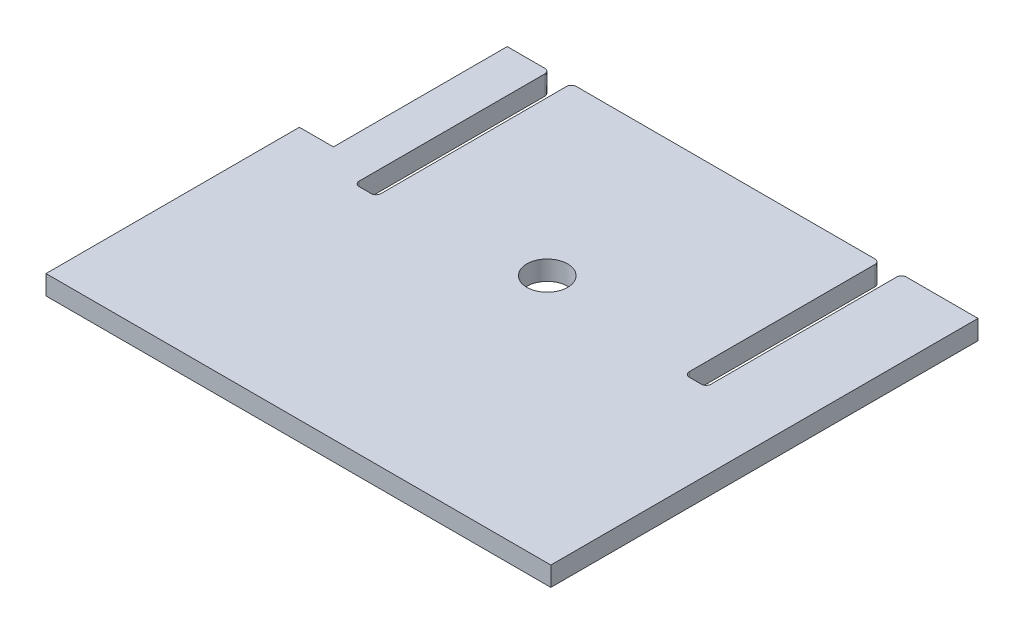
ISO-10303-21;
HEADER;
FILE_DESCRIPTION(('STEP AP214'),'2;1');
FILE_NAME('part.step','',(''),(''),'','','');
FILE_SCHEMA(('AUTOMOTIVE_DESIGN { 1 0 10303 214 1 1 1 1 }'));
ENDSEC;
DATA;
#1=APPLICATION_CONTEXT('core data for automotive mechanical design processes');
#2=APPLICATION_PROTOCOL_DEFINITION('international standard','automotive_design',2000,#1);
#3=PRODUCT_CONTEXT('',#1,'mechanical');
#4=PRODUCT('Part','Part','',(#3));
#5=PRODUCT_RELATED_PRODUCT_CATEGORY('part','',(#4));
#6=PRODUCT_DEFINITION_FORMATION('','',#4);
#7=PRODUCT_DEFINITION_CONTEXT('part definition',#1,'design');
#8=PRODUCT_DEFINITION('design','',#6,#7);
#9=PRODUCT_DEFINITION_SHAPE('','',#8);
#10=(LENGTH_UNIT() NAMED_UNIT(*) SI_UNIT(.MILLI.,.METRE.));
#11=(NAMED_UNIT(*) PLANE_ANGLE_UNIT() SI_UNIT($,.RADIAN.));
#12=(NAMED_UNIT(*) SI_UNIT($,.STERADIAN.) SOLID_ANGLE_UNIT());
#13=UNCERTAINTY_MEASURE_WITH_UNIT(LENGTH_MEASURE(1.E-05),#10,'distance_accuracy_value','');
#14=(GEOMETRIC_REPRESENTATION_CONTEXT(3) GLOBAL_UNCERTAINTY_ASSIGNED_CONTEXT((#13)) GLOBAL_UNIT_ASSIGNED_CONTEXT((#10,
#11,#12)) REPRESENTATION_CONTEXT('',''));
#15=CARTESIAN_POINT('',(0.,0.,0.));
#16=DIRECTION('',(0.,0.,1.));
#17=DIRECTION('',(1.,0.,0.));
#18=AXIS2_PLACEMENT_3D('',#15,#16,#17);
#19=CARTESIAN_POINT('',(734.900000000007,311.15,133.35));
#20=DIRECTION('',(1.,0.,0.));
#21=DIRECTION('',(0.,0.,-1.));
#22=AXIS2_PLACEMENT_3D('',#19,#20,#21);
#23=PLANE('',#22);
#24=DIRECTION('',(0.,0.,1.));
#25=VECTOR('',#24,1.);
#26=CARTESIAN_POINT('',(734.900000000007,311.15,133.35));
#27=LINE('',#26,#25);
#28=CARTESIAN_POINT('',(734.900000000007,311.15,247.022619584823));
#29=VERTEX_POINT('',#28);
#30=CARTESIAN_POINT('',(734.900000000007,311.15,412.75));
#31=VERTEX_POINT('',#30);
#32=EDGE_CURVE('E214',#29,#31,#27,.T.);
#33=ORIENTED_EDGE('',*,*,#32,.F.);
#34=DIRECTION('',(0.,1.,0.));
#35=VECTOR('',#34,1.);
#36=CARTESIAN_POINT('',(734.900000000007,298.45,247.022619584823));
#37=LINE('',#36,#35);
#38=CARTESIAN_POINT('',(734.900000000007,298.45,247.022619584823));
#39=VERTEX_POINT('',#38);
#40=EDGE_CURVE('E199',#39,#29,#37,.T.);
#41=ORIENTED_EDGE('',*,*,#40,.F.);
#42=DIRECTION('',(0.,0.,1.));
#43=VECTOR('',#42,1.);
#44=CARTESIAN_POINT('',(734.900000000007,298.45,133.35));
#45=LINE('',#44,#43);
#46=CARTESIAN_POINT('',(734.900000000007,298.45,412.75));
#47=VERTEX_POINT('',#46);
#48=EDGE_CURVE('E212',#39,#47,#45,.T.);
#49=ORIENTED_EDGE('',*,*,#48,.T.);
#50=DIRECTION('',(0.,-1.,0.));
#51=VECTOR('',#50,1.);
#52=CARTESIAN_POINT('',(734.900000000007,311.15,412.75));
#53=LINE('',#52,#51);
#54=EDGE_CURVE('E228',#31,#47,#53,.T.);
#55=ORIENTED_EDGE('',*,*,#54,.F.);
#56=EDGE_LOOP('',(#33,#41,#49,#55));
#57=FACE_BOUND('',#56,.T.);
#58=ADVANCED_FACE('F44',(#57),#23,.F.);
#59=CARTESIAN_POINT('',(1014.30000000001,311.15,412.75));
#60=DIRECTION('',(0.,0.,-1.));
#61=DIRECTION('',(-1.,0.,0.));
#62=AXIS2_PLACEMENT_3D('',#59,#60,#61);
#63=PLANE('',#62);
#64=DIRECTION('',(1.,0.,0.));
#65=VECTOR('',#64,1.);
#66=CARTESIAN_POINT('',(1014.30000000001,298.45,412.75));
#67=LINE('',#66,#65);
#68=CARTESIAN_POINT('',(1065.10000000001,298.45,412.75));
#69=VERTEX_POINT('',#68);
#70=EDGE_CURVE('E221',#47,#69,#67,.T.);
#71=ORIENTED_EDGE('',*,*,#70,.T.);
#72=DIRECTION('',(0.,-1.,0.));
#73=VECTOR('',#72,1.);
#74=CARTESIAN_POINT('',(1065.10000000001,311.15,412.75));
#75=LINE('',#74,#73);
#76=CARTESIAN_POINT('',(1065.10000000001,311.15,412.75));
#77=VERTEX_POINT('',#76);
#78=EDGE_CURVE('E427',#77,#69,#75,.T.);
#79=ORIENTED_EDGE('',*,*,#78,.F.);
#80=DIRECTION('',(1.,0.,0.));
#81=VECTOR('',#80,1.);
#82=CARTESIAN_POINT('',(734.900000000007,311.15,412.75));
#83=LINE('',#82,#81);
#84=EDGE_CURVE('E234',#31,#77,#83,.T.);
#85=ORIENTED_EDGE('',*,*,#84,.F.);
#86=ORIENTED_EDGE('',*,*,#54,.T.);
#87=EDGE_LOOP('',(#71,#79,#85,#86));
#88=FACE_BOUND('',#87,.T.);
#89=ADVANCED_FACE('F446',(#88),#63,.F.);
#90=CARTESIAN_POINT('',(1065.10000000001,311.15,133.35));
#91=DIRECTION('',(-1.,0.,0.));
#92=DIRECTION('',(0.,0.,1.));
#93=AXIS2_PLACEMENT_3D('',#90,#91,#92);
#94=PLANE('',#93);
#95=DIRECTION('',(0.,0.,-1.));
#96=VECTOR('',#95,1.);
#97=CARTESIAN_POINT('',(1065.10000000001,298.45,133.35));
#98=LINE('',#97,#96);
#99=CARTESIAN_POINT('',(1065.10000000001,298.45,133.35));
#100=VERTEX_POINT('',#99);
#101=EDGE_CURVE('E428',#69,#100,#98,.T.);
#102=ORIENTED_EDGE('',*,*,#101,.T.);
#103=DIRECTION('',(0.,-1.,0.));
#104=VECTOR('',#103,1.);
#105=CARTESIAN_POINT('',(1065.10000000001,311.15,133.35));
#106=LINE('',#105,#104);
#107=CARTESIAN_POINT('',(1065.10000000001,311.15,133.35));
#108=VERTEX_POINT('',#107);
#109=EDGE_CURVE('E244',#108,#100,#106,.T.);
#110=ORIENTED_EDGE('',*,*,#109,.F.);
#111=DIRECTION('',(0.,0.,-1.));
#112=VECTOR('',#111,1.);
#113=CARTESIAN_POINT('',(1065.10000000001,311.15,133.35));
#114=LINE('',#113,#112);
#115=EDGE_CURVE('E437',#77,#108,#114,.T.);
#116=ORIENTED_EDGE('',*,*,#115,.F.);
#117=ORIENTED_EDGE('',*,*,#78,.T.);
#118=EDGE_LOOP('',(#102,#110,#116,#117));
#119=FACE_BOUND('',#118,.T.);
#120=ADVANCED_FACE('F449',(#119),#94,.F.);
#121=CARTESIAN_POINT('',(1014.3,311.15,133.35));
#122=DIRECTION('',(0.,0.,1.));
#123=DIRECTION('',(1.,0.,0.));
#124=AXIS2_PLACEMENT_3D('',#121,#122,#123);
#125=PLANE('',#124);
#126=DIRECTION('',(-1.,0.,0.));
#127=VECTOR('',#126,1.);
#128=CARTESIAN_POINT('',(1014.3,298.45,133.35));
#129=LINE('',#128,#127);
#130=CARTESIAN_POINT('',(1018.237,298.45,133.35));
#131=VERTEX_POINT('',#130);
#132=EDGE_CURVE('E423',#100,#131,#129,.T.);
#133=ORIENTED_EDGE('',*,*,#132,.T.);
#134=DIRECTION('',(0.,-1.,0.));
#135=VECTOR('',#134,1.);
#136=CARTESIAN_POINT('',(1018.237,311.15,133.35));
#137=LINE('',#136,#135);
#138=CARTESIAN_POINT('',(1018.237,311.15,133.35));
#139=VERTEX_POINT('',#138);
#140=EDGE_CURVE('E317',#131,#139,#137,.F.);
#141=ORIENTED_EDGE('',*,*,#140,.T.);
#142=DIRECTION('',(-1.,0.,0.));
#143=VECTOR('',#142,1.);
#144=CARTESIAN_POINT('',(1014.3,311.15,133.35));
#145=LINE('',#144,#143);
#146=EDGE_CURVE('E250',#108,#139,#145,.T.);
#147=ORIENTED_EDGE('',*,*,#146,.F.);
#148=ORIENTED_EDGE('',*,*,#109,.T.);
#149=EDGE_LOOP('',(#133,#141,#147,#148));
#150=FACE_BOUND('',#149,.T.);
#151=ADVANCED_FACE('F455',(#150),#125,.F.);
#152=CARTESIAN_POINT('',(1015.062,311.15,260.35));
#153=DIRECTION('',(1.,0.,0.));
#154=DIRECTION('',(0.,0.,-1.));
#155=AXIS2_PLACEMENT_3D('',#152,#153,#154);
#156=PLANE('',#155);
#157=DIRECTION('',(0.,0.,1.));
#158=VECTOR('',#157,1.);
#159=CARTESIAN_POINT('',(1015.062,311.15,260.35));
#160=LINE('',#159,#158);
#161=CARTESIAN_POINT('',(1015.062,311.15,136.525));
#162=VERTEX_POINT('',#161);
#163=CARTESIAN_POINT('',(1015.062,311.15,257.937));
#164=VERTEX_POINT('',#163);
#165=EDGE_CURVE('E245',#162,#164,#160,.T.);
#166=ORIENTED_EDGE('',*,*,#165,.F.);
#167=DIRECTION('',(0.,-1.,0.));
#168=VECTOR('',#167,1.);
#169=CARTESIAN_POINT('',(1015.062,311.15,136.525));
#170=LINE('',#169,#168);
#171=CARTESIAN_POINT('',(1015.062,298.45,136.525));
#172=VERTEX_POINT('',#171);
#173=EDGE_CURVE('E301',#162,#172,#170,.T.);
#174=ORIENTED_EDGE('',*,*,#173,.T.);
#175=DIRECTION('',(0.,0.,1.));
#176=VECTOR('',#175,1.);
#177=CARTESIAN_POINT('',(1015.062,298.45,260.35));
#178=LINE('',#177,#176);
#179=CARTESIAN_POINT('',(1015.062,298.45,257.937));
#180=VERTEX_POINT('',#179);
#181=EDGE_CURVE('E239',#172,#180,#178,.T.);
#182=ORIENTED_EDGE('',*,*,#181,.T.);
#183=DIRECTION('',(0.,-1.,0.));
#184=VECTOR('',#183,1.);
#185=CARTESIAN_POINT('',(1015.062,311.15,257.937));
#186=LINE('',#185,#184);
#187=EDGE_CURVE('E298',#180,#164,#186,.F.);
#188=ORIENTED_EDGE('',*,*,#187,.T.);
#189=EDGE_LOOP('',(#166,#174,#182,#188));
#190=FACE_BOUND('',#189,.T.);
#191=ADVANCED_FACE('F463',(#190),#156,.F.);
#192=CARTESIAN_POINT('',(1001.6,311.15,261.112));
#193=DIRECTION('',(0.,0.,1.));
#194=DIRECTION('',(1.,0.,0.));
#195=AXIS2_PLACEMENT_3D('',#192,#193,#194);
#196=PLANE('',#195);
#197=DIRECTION('',(-1.,0.,0.));
#198=VECTOR('',#197,1.);
#199=CARTESIAN_POINT('',(1001.6,311.15,261.112));
#200=LINE('',#199,#198);
#201=CARTESIAN_POINT('',(1011.887,311.15,261.112));
#202=VERTEX_POINT('',#201);
#203=CARTESIAN_POINT('',(1004.013,311.15,261.112));
#204=VERTEX_POINT('',#203);
#205=EDGE_CURVE('E249',#202,#204,#200,.T.);
#206=ORIENTED_EDGE('',*,*,#205,.F.);
#207=DIRECTION('',(0.,-1.,0.));
#208=VECTOR('',#207,1.);
#209=CARTESIAN_POINT('',(1011.887,298.45,261.112));
#210=LINE('',#209,#208);
#211=CARTESIAN_POINT('',(1011.887,298.45,261.112));
#212=VERTEX_POINT('',#211);
#213=EDGE_CURVE('E365',#202,#212,#210,.T.);
#214=ORIENTED_EDGE('',*,*,#213,.T.);
#215=DIRECTION('',(-1.,0.,0.));
#216=VECTOR('',#215,1.);
#217=CARTESIAN_POINT('',(1001.6,298.45,261.112));
#218=LINE('',#217,#216);
#219=CARTESIAN_POINT('',(1004.013,298.45,261.112));
#220=VERTEX_POINT('',#219);
#221=EDGE_CURVE('E243',#212,#220,#218,.T.);
#222=ORIENTED_EDGE('',*,*,#221,.T.);
#223=DIRECTION('',(0.,-1.,0.));
#224=VECTOR('',#223,1.);
#225=CARTESIAN_POINT('',(1004.013,311.15,261.112));
#226=LINE('',#225,#224);
#227=EDGE_CURVE('E362',#220,#204,#226,.F.);
#228=ORIENTED_EDGE('',*,*,#227,.T.);
#229=EDGE_LOOP('',(#206,#214,#222,#228));
#230=FACE_BOUND('',#229,.T.);
#231=ADVANCED_FACE('F472',(#230),#196,.F.);
#232=CARTESIAN_POINT('',(1000.838,311.15,133.35));
#233=DIRECTION('',(-1.,0.,0.));
#234=DIRECTION('',(0.,0.,1.));
#235=AXIS2_PLACEMENT_3D('',#232,#233,#234);
#236=PLANE('',#235);
#237=DIRECTION('',(0.,0.,-1.));
#238=VECTOR('',#237,1.);
#239=CARTESIAN_POINT('',(1000.838,298.45,133.35));
#240=LINE('',#239,#238);
#241=CARTESIAN_POINT('',(1000.838,298.45,257.937));
#242=VERTEX_POINT('',#241);
#243=CARTESIAN_POINT('',(1000.838,298.45,136.525));
#244=VERTEX_POINT('',#243);
#245=EDGE_CURVE('E259',#242,#244,#240,.T.);
#246=ORIENTED_EDGE('',*,*,#245,.T.);
#247=DIRECTION('',(0.,-1.,0.));
#248=VECTOR('',#247,1.);
#249=CARTESIAN_POINT('',(1000.838,311.15,136.525));
#250=LINE('',#249,#248);
#251=CARTESIAN_POINT('',(1000.838,311.15,136.525));
#252=VERTEX_POINT('',#251);
#253=EDGE_CURVE('E342',#244,#252,#250,.F.);
#254=ORIENTED_EDGE('',*,*,#253,.T.);
#255=DIRECTION('',(0.,0.,-1.));
#256=VECTOR('',#255,1.);
#257=CARTESIAN_POINT('',(1000.838,311.15,133.35));
#258=LINE('',#257,#256);
#259=CARTESIAN_POINT('',(1000.838,311.15,257.937));
#260=VERTEX_POINT('',#259);
#261=EDGE_CURVE('E254',#260,#252,#258,.T.);
#262=ORIENTED_EDGE('',*,*,#261,.F.);
#263=DIRECTION('',(0.,-1.,0.));
#264=VECTOR('',#263,1.);
#265=CARTESIAN_POINT('',(1000.838,298.45,257.937));
#266=LINE('',#265,#264);
#267=EDGE_CURVE('E338',#260,#242,#266,.T.);
#268=ORIENTED_EDGE('',*,*,#267,.T.);
#269=EDGE_LOOP('',(#246,#254,#262,#268));
#270=FACE_BOUND('',#269,.T.);
#271=ADVANCED_FACE('F481',(#270),#236,.F.);
#272=CARTESIAN_POINT('',(798.400000000003,311.15,133.35));
#273=DIRECTION('',(0.,0.,1.));
#274=DIRECTION('',(1.,0.,0.));
#275=AXIS2_PLACEMENT_3D('',#272,#273,#274);
#276=PLANE('',#275);
#277=DIRECTION('',(-1.,0.,0.));
#278=VECTOR('',#277,1.);
#279=CARTESIAN_POINT('',(798.400000000003,311.15,133.35));
#280=LINE('',#279,#278);
#281=CARTESIAN_POINT('',(997.663000000003,311.15,133.35));
#282=VERTEX_POINT('',#281);
#283=CARTESIAN_POINT('',(802.337000000003,311.15,133.35));
#284=VERTEX_POINT('',#283);
#285=EDGE_CURVE('E258',#282,#284,#280,.T.);
#286=ORIENTED_EDGE('',*,*,#285,.F.);
#287=DIRECTION('',(0.,-1.,0.));
#288=VECTOR('',#287,1.);
#289=CARTESIAN_POINT('',(997.663000000003,311.15,133.35));
#290=LINE('',#289,#288);
#291=CARTESIAN_POINT('',(997.663000000003,298.45,133.35));
#292=VERTEX_POINT('',#291);
#293=EDGE_CURVE('E334',#282,#292,#290,.T.);
#294=ORIENTED_EDGE('',*,*,#293,.T.);
#295=DIRECTION('',(-1.,0.,0.));
#296=VECTOR('',#295,1.);
#297=CARTESIAN_POINT('',(798.400000000003,298.45,133.35));
#298=LINE('',#297,#296);
#299=CARTESIAN_POINT('',(802.337000000003,298.45,133.35));
#300=VERTEX_POINT('',#299);
#301=EDGE_CURVE('E263',#292,#300,#298,.T.);
#302=ORIENTED_EDGE('',*,*,#301,.T.);
#303=DIRECTION('',(0.,-1.,0.));
#304=VECTOR('',#303,1.);
#305=CARTESIAN_POINT('',(802.337000000003,311.15,133.35));
#306=LINE('',#305,#304);
#307=EDGE_CURVE('E331',#300,#284,#306,.F.);
#308=ORIENTED_EDGE('',*,*,#307,.T.);
#309=EDGE_LOOP('',(#286,#294,#302,#308));
#310=FACE_BOUND('',#309,.T.);
#311=ADVANCED_FACE('F490',(#310),#276,.F.);
#312=CARTESIAN_POINT('',(799.162000000004,311.15,260.35));
#313=DIRECTION('',(1.,0.,0.));
#314=DIRECTION('',(0.,0.,-1.));
#315=AXIS2_PLACEMENT_3D('',#312,#313,#314);
#316=PLANE('',#315);
#317=DIRECTION('',(0.,0.,1.));
#318=VECTOR('',#317,1.);
#319=CARTESIAN_POINT('',(799.162000000004,311.15,260.35));
#320=LINE('',#319,#318);
#321=CARTESIAN_POINT('',(799.162000000003,311.15,136.525));
#322=VERTEX_POINT('',#321);
#323=CARTESIAN_POINT('',(799.162000000004,311.15,257.937));
#324=VERTEX_POINT('',#323);
#325=EDGE_CURVE('E279',#322,#324,#320,.T.);
#326=ORIENTED_EDGE('',*,*,#325,.F.);
#327=DIRECTION('',(0.,-1.,0.));
#328=VECTOR('',#327,1.);
#329=CARTESIAN_POINT('',(799.162000000003,311.15,136.525));
#330=LINE('',#329,#328);
#331=CARTESIAN_POINT('',(799.162000000003,298.45,136.525));
#332=VERTEX_POINT('',#331);
#333=EDGE_CURVE('E348',#322,#332,#330,.T.);
#334=ORIENTED_EDGE('',*,*,#333,.T.);
#335=DIRECTION('',(0.,0.,1.));
#336=VECTOR('',#335,1.);
#337=CARTESIAN_POINT('',(799.162000000004,298.45,260.35));
#338=LINE('',#337,#336);
#339=CARTESIAN_POINT('',(799.162000000004,298.45,257.937));
#340=VERTEX_POINT('',#339);
#341=EDGE_CURVE('E275',#332,#340,#338,.T.);
#342=ORIENTED_EDGE('',*,*,#341,.T.);
#343=DIRECTION('',(0.,-1.,0.));
#344=VECTOR('',#343,1.);
#345=CARTESIAN_POINT('',(799.162000000004,311.15,257.937));
#346=LINE('',#345,#344);
#347=EDGE_CURVE('E345',#340,#324,#346,.F.);
#348=ORIENTED_EDGE('',*,*,#347,.T.);
#349=EDGE_LOOP('',(#326,#334,#342,#348));
#350=FACE_BOUND('',#349,.T.);
#351=ADVANCED_FACE('F499',(#350),#316,.F.);
#352=CARTESIAN_POINT('',(785.700000000007,311.15,261.112));
#353=DIRECTION('',(0.,0.,1.));
#354=DIRECTION('',(1.,0.,0.));
#355=AXIS2_PLACEMENT_3D('',#352,#353,#354);
#356=PLANE('',#355);
#357=DIRECTION('',(-1.,0.,0.));
#358=VECTOR('',#357,1.);
#359=CARTESIAN_POINT('',(785.700000000007,311.15,261.112));
#360=LINE('',#359,#358);
#361=CARTESIAN_POINT('',(795.987000000004,311.15,261.112));
#362=VERTEX_POINT('',#361);
#363=CARTESIAN_POINT('',(788.113000000007,311.15,261.112));
#364=VERTEX_POINT('',#363);
#365=EDGE_CURVE('E283',#362,#364,#360,.T.);
#366=ORIENTED_EDGE('',*,*,#365,.F.);
#367=DIRECTION('',(0.,-1.,0.));
#368=VECTOR('',#367,1.);
#369=CARTESIAN_POINT('',(795.987000000004,298.45,261.112));
#370=LINE('',#369,#368);
#371=CARTESIAN_POINT('',(795.987000000004,298.45,261.112));
#372=VERTEX_POINT('',#371);
#373=EDGE_CURVE('E372',#362,#372,#370,.T.);
#374=ORIENTED_EDGE('',*,*,#373,.T.);
#375=DIRECTION('',(-1.,0.,0.));
#376=VECTOR('',#375,1.);
#377=CARTESIAN_POINT('',(785.700000000007,298.45,261.112));
#378=LINE('',#377,#376);
#379=CARTESIAN_POINT('',(788.113000000007,298.45,261.112));
#380=VERTEX_POINT('',#379);
#381=EDGE_CURVE('E271',#372,#380,#378,.T.);
#382=ORIENTED_EDGE('',*,*,#381,.T.);
#383=DIRECTION('',(0.,-1.,0.));
#384=VECTOR('',#383,1.);
#385=CARTESIAN_POINT('',(788.113000000007,311.15,261.112));
#386=LINE('',#385,#384);
#387=EDGE_CURVE('E369',#380,#364,#386,.F.);
#388=ORIENTED_EDGE('',*,*,#387,.T.);
#389=EDGE_LOOP('',(#366,#374,#382,#388));
#390=FACE_BOUND('',#389,.T.);
#391=ADVANCED_FACE('F401',(#390),#356,.F.);
#392=CARTESIAN_POINT('',(784.938000000003,311.15,133.35));
#393=DIRECTION('',(-1.,0.,0.));
#394=DIRECTION('',(0.,0.,1.));
#395=AXIS2_PLACEMENT_3D('',#392,#393,#394);
#396=PLANE('',#395);
#397=DIRECTION('',(0.,0.,-1.));
#398=VECTOR('',#397,1.);
#399=CARTESIAN_POINT('',(784.938000000003,298.45,133.35));
#400=LINE('',#399,#398);
#401=CARTESIAN_POINT('',(784.938000000006,298.45,257.937));
#402=VERTEX_POINT('',#401);
#403=CARTESIAN_POINT('',(784.938000000003,298.45,136.525));
#404=VERTEX_POINT('',#403);
#405=EDGE_CURVE('E267',#402,#404,#400,.T.);
#406=ORIENTED_EDGE('',*,*,#405,.T.);
#407=DIRECTION('',(0.,-1.,0.));
#408=VECTOR('',#407,1.);
#409=CARTESIAN_POINT('',(784.938000000003,311.15,136.525));
#410=LINE('',#409,#408);
#411=CARTESIAN_POINT('',(784.938000000003,311.15,136.525));
#412=VERTEX_POINT('',#411);
#413=EDGE_CURVE('E68',#404,#412,#410,.F.);
#414=ORIENTED_EDGE('',*,*,#413,.T.);
#415=DIRECTION('',(0.,0.,-1.));
#416=VECTOR('',#415,1.);
#417=CARTESIAN_POINT('',(784.938000000003,311.15,133.35));
#418=LINE('',#417,#416);
#419=CARTESIAN_POINT('',(784.938000000006,311.15,257.937));
#420=VERTEX_POINT('',#419);
#421=EDGE_CURVE('E287',#420,#412,#418,.T.);
#422=ORIENTED_EDGE('',*,*,#421,.F.);
#423=DIRECTION('',(0.,-1.,0.));
#424=VECTOR('',#423,1.);
#425=CARTESIAN_POINT('',(784.938000000006,298.45,257.937));
#426=LINE('',#425,#424);
#427=EDGE_CURVE('E356',#420,#402,#426,.T.);
#428=ORIENTED_EDGE('',*,*,#427,.T.);
#429=EDGE_LOOP('',(#406,#414,#422,#428));
#430=FACE_BOUND('',#429,.T.);
#431=ADVANCED_FACE('F407',(#430),#396,.F.);
#432=CARTESIAN_POINT('',(734.900000000007,311.15,133.35));
#433=DIRECTION('',(0.,0.,1.));
#434=DIRECTION('',(1.,0.,0.));
#435=AXIS2_PLACEMENT_3D('',#432,#433,#434);
#436=PLANE('',#435);
#437=DIRECTION('',(-1.,0.,0.));
#438=VECTOR('',#437,1.);
#439=CARTESIAN_POINT('',(734.900000000007,311.15,133.35));
#440=LINE('',#439,#438);
#441=CARTESIAN_POINT('',(781.763000000003,311.15,133.35));
#442=VERTEX_POINT('',#441);
#443=CARTESIAN_POINT('',(757.170177668499,311.15,133.35));
#444=VERTEX_POINT('',#443);
#445=EDGE_CURVE('E290',#442,#444,#440,.T.);
#446=ORIENTED_EDGE('',*,*,#445,.F.);
#447=DIRECTION('',(0.,-1.,0.));
#448=VECTOR('',#447,1.);
#449=CARTESIAN_POINT('',(781.763000000003,311.15,133.35));
#450=LINE('',#449,#448);
#451=CARTESIAN_POINT('',(781.763000000003,298.45,133.35));
#452=VERTEX_POINT('',#451);
#453=EDGE_CURVE('E352',#442,#452,#450,.T.);
#454=ORIENTED_EDGE('',*,*,#453,.T.);
#455=DIRECTION('',(-1.,0.,0.));
#456=VECTOR('',#455,1.);
#457=CARTESIAN_POINT('',(734.900000000007,298.45,133.35));
#458=LINE('',#457,#456);
#459=CARTESIAN_POINT('',(757.170177668499,298.45,133.35));
#460=VERTEX_POINT('',#459);
#461=EDGE_CURVE('E270',#452,#460,#458,.T.);
#462=ORIENTED_EDGE('',*,*,#461,.T.);
#463=DIRECTION('',(0.,1.,0.));
#464=VECTOR('',#463,1.);
#465=CARTESIAN_POINT('',(757.170177668499,298.45,133.35));
#466=LINE('',#465,#464);
#467=EDGE_CURVE('E224',#460,#444,#466,.T.);
#468=ORIENTED_EDGE('',*,*,#467,.T.);
#469=EDGE_LOOP('',(#446,#454,#462,#468));
#470=FACE_BOUND('',#469,.T.);
#471=ADVANCED_FACE('F413',(#470),#436,.F.);
#472=CARTESIAN_POINT('',(0.,311.15,0.));
#473=DIRECTION('',(0.,1.,0.));
#474=DIRECTION('',(0.,0.,1.));
#475=AXIS2_PLACEMENT_3D('',#472,#473,#474);
#476=PLANE('',#475);
#477=ORIENTED_EDGE('',*,*,#146,.T.);
#478=CARTESIAN_POINT('',(1018.237,311.15,136.525));
#479=DIRECTION('',(0.,1.,0.));
#480=DIRECTION('',(0.,0.,1.));
#481=AXIS2_PLACEMENT_3D('',#478,#479,#480);
#482=CIRCLE('',#481,3.175);
#483=EDGE_CURVE('E328',#139,#162,#482,.T.);
#484=ORIENTED_EDGE('',*,*,#483,.T.);
#485=ORIENTED_EDGE('',*,*,#165,.T.);
#486=CARTESIAN_POINT('',(1011.887,311.15,257.937));
#487=DIRECTION('',(0.,1.,0.));
#488=DIRECTION('',(0.,0.,1.));
#489=AXIS2_PLACEMENT_3D('',#486,#487,#488);
#490=CIRCLE('',#489,3.175);
#491=EDGE_CURVE('E379',#164,#202,#490,.F.);
#492=ORIENTED_EDGE('',*,*,#491,.T.);
#493=ORIENTED_EDGE('',*,*,#205,.T.);
#494=CARTESIAN_POINT('',(1004.013,311.15,257.937));
#495=DIRECTION('',(0.,1.,0.));
#496=DIRECTION('',(0.,0.,1.));
#497=AXIS2_PLACEMENT_3D('',#494,#495,#496);
#498=CIRCLE('',#497,3.175);
#499=EDGE_CURVE('E385',#204,#260,#498,.F.);
#500=ORIENTED_EDGE('',*,*,#499,.T.);
#501=ORIENTED_EDGE('',*,*,#261,.T.);
#502=CARTESIAN_POINT('',(997.663000000003,311.15,136.525));
#503=DIRECTION('',(0.,1.,0.));
#504=DIRECTION('',(0.,0.,1.));
#505=AXIS2_PLACEMENT_3D('',#502,#503,#504);
#506=CIRCLE('',#505,3.175);
#507=EDGE_CURVE('E325',#252,#282,#506,.T.);
#508=ORIENTED_EDGE('',*,*,#507,.T.);
#509=ORIENTED_EDGE('',*,*,#285,.T.);
#510=CARTESIAN_POINT('',(802.337000000003,311.15,136.525));
#511=DIRECTION('',(0.,1.,0.));
#512=DIRECTION('',(0.,0.,1.));
#513=AXIS2_PLACEMENT_3D('',#510,#511,#512);
#514=CIRCLE('',#513,3.175);
#515=EDGE_CURVE('E322',#284,#322,#514,.T.);
#516=ORIENTED_EDGE('',*,*,#515,.T.);
#517=ORIENTED_EDGE('',*,*,#325,.T.);
#518=CARTESIAN_POINT('',(795.987000000004,311.15,257.937));
#519=DIRECTION('',(0.,1.,0.));
#520=DIRECTION('',(0.,0.,1.));
#521=AXIS2_PLACEMENT_3D('',#518,#519,#520);
#522=CIRCLE('',#521,3.175);
#523=EDGE_CURVE('E391',#324,#362,#522,.F.);
#524=ORIENTED_EDGE('',*,*,#523,.T.);
#525=ORIENTED_EDGE('',*,*,#365,.T.);
#526=CARTESIAN_POINT('',(788.113000000007,311.15,257.937));
#527=DIRECTION('',(0.,1.,0.));
#528=DIRECTION('',(0.,0.,1.));
#529=AXIS2_PLACEMENT_3D('',#526,#527,#528);
#530=CIRCLE('',#529,3.175);
#531=EDGE_CURVE('E12',#364,#420,#530,.F.);
#532=ORIENTED_EDGE('',*,*,#531,.T.);
#533=ORIENTED_EDGE('',*,*,#421,.T.);
#534=CARTESIAN_POINT('',(781.763000000003,311.15,136.525));
#535=DIRECTION('',(0.,1.,0.));
#536=DIRECTION('',(0.,0.,1.));
#537=AXIS2_PLACEMENT_3D('',#534,#535,#536);
#538=CIRCLE('',#537,3.175);
#539=EDGE_CURVE('E60',#412,#442,#538,.T.);
#540=ORIENTED_EDGE('',*,*,#539,.T.);
#541=ORIENTED_EDGE('',*,*,#445,.T.);
#542=DIRECTION('',(0.,0.,-1.));
#543=VECTOR('',#542,1.);
#544=CARTESIAN_POINT('',(757.170177668499,311.15,133.35));
#545=LINE('',#544,#543);
#546=CARTESIAN_POINT('',(757.170177668499,311.15,247.022619584823));
#547=VERTEX_POINT('',#546);
#548=EDGE_CURVE('E207',#547,#444,#545,.T.);
#549=ORIENTED_EDGE('',*,*,#548,.F.);
#550=DIRECTION('',(1.,0.,0.));
#551=VECTOR('',#550,1.);
#552=CARTESIAN_POINT('',(734.900000000007,311.15,247.022619584823));
#553=LINE('',#552,#551);
#554=EDGE_CURVE('E771',#29,#547,#553,.T.);
#555=ORIENTED_EDGE('',*,*,#554,.F.);
#556=ORIENTED_EDGE('',*,*,#32,.T.);
#557=ORIENTED_EDGE('',*,*,#84,.T.);
#558=ORIENTED_EDGE('',*,*,#115,.T.);
#559=EDGE_LOOP('',(#477,#484,#485,#492,#493,#500,#501,#508,#509,#516,#517,#524,#525,#532,#533,
#540,#541,#549,#555,#556,#557,#558));
#560=FACE_BOUND('',#559,.T.);
#561=CARTESIAN_POINT('',(899.999999999995,311.15,249.999999999999));
#562=DIRECTION('',(0.,1.,0.));
#563=DIRECTION('',(0.,0.,1.));
#564=AXIS2_PLACEMENT_3D('',#561,#562,#563);
#565=CIRCLE('',#564,13.335);
#566=CARTESIAN_POINT('',(899.999999999995,311.15,263.334999999999));
#567=VERTEX_POINT('',#566);
#568=EDGE_CURVE('E238',#567,#567,#565,.F.);
#569=ORIENTED_EDGE('',*,*,#568,.T.);
#570=EDGE_LOOP('',(#569));
#571=FACE_BOUND('',#570,.T.);
#572=ADVANCED_FACE('F405',(#560,#571),#476,.T.);
#573=CARTESIAN_POINT('',(0.,298.45,0.));
#574=DIRECTION('',(0.,1.,0.));
#575=DIRECTION('',(0.,0.,1.));
#576=AXIS2_PLACEMENT_3D('',#573,#574,#575);
#577=PLANE('',#576);
#578=ORIENTED_EDGE('',*,*,#181,.F.);
#579=CARTESIAN_POINT('',(1018.237,298.45,136.525));
#580=DIRECTION('',(0.,1.,0.));
#581=DIRECTION('',(0.,0.,1.));
#582=AXIS2_PLACEMENT_3D('',#579,#580,#581);
#583=CIRCLE('',#582,3.175);
#584=EDGE_CURVE('E314',#172,#131,#583,.F.);
#585=ORIENTED_EDGE('',*,*,#584,.T.);
#586=ORIENTED_EDGE('',*,*,#132,.F.);
#587=ORIENTED_EDGE('',*,*,#101,.F.);
#588=ORIENTED_EDGE('',*,*,#70,.F.);
#589=ORIENTED_EDGE('',*,*,#48,.F.);
#590=DIRECTION('',(1.,0.,0.));
#591=VECTOR('',#590,1.);
#592=CARTESIAN_POINT('',(734.900000000007,298.45,247.022619584823));
#593=LINE('',#592,#591);
#594=CARTESIAN_POINT('',(757.170177668499,298.45,247.022619584823));
#595=VERTEX_POINT('',#594);
#596=EDGE_CURVE('E195',#39,#595,#593,.T.);
#597=ORIENTED_EDGE('',*,*,#596,.T.);
#598=DIRECTION('',(0.,0.,-1.));
#599=VECTOR('',#598,1.);
#600=CARTESIAN_POINT('',(757.170177668499,298.45,133.35));
#601=LINE('',#600,#599);
#602=EDGE_CURVE('E206',#595,#460,#601,.T.);
#603=ORIENTED_EDGE('',*,*,#602,.T.);
#604=ORIENTED_EDGE('',*,*,#461,.F.);
#605=CARTESIAN_POINT('',(781.763000000003,298.45,136.525));
#606=DIRECTION('',(0.,1.,0.));
#607=DIRECTION('',(0.,0.,1.));
#608=AXIS2_PLACEMENT_3D('',#605,#606,#607);
#609=CIRCLE('',#608,3.175);
#610=EDGE_CURVE('E305',#452,#404,#609,.F.);
#611=ORIENTED_EDGE('',*,*,#610,.T.);
#612=ORIENTED_EDGE('',*,*,#405,.F.);
#613=CARTESIAN_POINT('',(788.113000000007,298.45,257.937));
#614=DIRECTION('',(0.,1.,0.));
#615=DIRECTION('',(0.,0.,1.));
#616=AXIS2_PLACEMENT_3D('',#613,#614,#615);
#617=CIRCLE('',#616,3.175);
#618=EDGE_CURVE('E53',#402,#380,#617,.T.);
#619=ORIENTED_EDGE('',*,*,#618,.T.);
#620=ORIENTED_EDGE('',*,*,#381,.F.);
#621=CARTESIAN_POINT('',(795.987000000004,298.45,257.937));
#622=DIRECTION('',(0.,1.,0.));
#623=DIRECTION('',(0.,0.,1.));
#624=AXIS2_PLACEMENT_3D('',#621,#622,#623);
#625=CIRCLE('',#624,3.175);
#626=EDGE_CURVE('E388',#372,#340,#625,.T.);
#627=ORIENTED_EDGE('',*,*,#626,.T.);
#628=ORIENTED_EDGE('',*,*,#341,.F.);
#629=CARTESIAN_POINT('',(802.337000000003,298.45,136.525));
#630=DIRECTION('',(0.,1.,0.));
#631=DIRECTION('',(0.,0.,1.));
#632=AXIS2_PLACEMENT_3D('',#629,#630,#631);
#633=CIRCLE('',#632,3.175);
#634=EDGE_CURVE('E308',#332,#300,#633,.F.);
#635=ORIENTED_EDGE('',*,*,#634,.T.);
#636=ORIENTED_EDGE('',*,*,#301,.F.);
#637=CARTESIAN_POINT('',(997.663000000003,298.45,136.525));
#638=DIRECTION('',(0.,1.,0.));
#639=DIRECTION('',(0.,0.,1.));
#640=AXIS2_PLACEMENT_3D('',#637,#638,#639);
#641=CIRCLE('',#640,3.175);
#642=EDGE_CURVE('E311',#292,#244,#641,.F.);
#643=ORIENTED_EDGE('',*,*,#642,.T.);
#644=ORIENTED_EDGE('',*,*,#245,.F.);
#645=CARTESIAN_POINT('',(1004.013,298.45,257.937));
#646=DIRECTION('',(0.,1.,0.));
#647=DIRECTION('',(0.,0.,1.));
#648=AXIS2_PLACEMENT_3D('',#645,#646,#647);
#649=CIRCLE('',#648,3.175);
#650=EDGE_CURVE('E382',#242,#220,#649,.T.);
#651=ORIENTED_EDGE('',*,*,#650,.T.);
#652=ORIENTED_EDGE('',*,*,#221,.F.);
#653=CARTESIAN_POINT('',(1011.887,298.45,257.937));
#654=DIRECTION('',(0.,1.,0.));
#655=DIRECTION('',(0.,0.,1.));
#656=AXIS2_PLACEMENT_3D('',#653,#654,#655);
#657=CIRCLE('',#656,3.175);
#658=EDGE_CURVE('E376',#212,#180,#657,.T.);
#659=ORIENTED_EDGE('',*,*,#658,.T.);
#660=EDGE_LOOP('',(#578,#585,#586,#587,#588,#589,#597,#603,#604,#611,#612,#619,#620,#627,#628,
#635,#636,#643,#644,#651,#652,#659));
#661=FACE_BOUND('',#660,.T.);
#662=CARTESIAN_POINT('',(899.999999999995,298.45,249.999999999999));
#663=DIRECTION('',(0.,1.,0.));
#664=DIRECTION('',(0.,0.,1.));
#665=AXIS2_PLACEMENT_3D('',#662,#663,#664);
#666=CIRCLE('',#665,13.335);
#667=CARTESIAN_POINT('',(899.999999999995,298.45,263.334999999999));
#668=VERTEX_POINT('',#667);
#669=EDGE_CURVE('E294',#668,#668,#666,.F.);
#670=ORIENTED_EDGE('',*,*,#669,.F.);
#671=EDGE_LOOP('',(#670));
#672=FACE_BOUND('',#671,.T.);
#673=ADVANCED_FACE('F218',(#661,#672),#577,.F.);
#674=CARTESIAN_POINT('',(899.999999999994,275.499546279119,249.999999999999));
#675=DIRECTION('',(0.,1.,0.));
#676=DIRECTION('',(-1.,0.,0.));
#677=AXIS2_PLACEMENT_3D('',#674,#675,#676);
#678=CYLINDRICAL_SURFACE('',#677,13.335);
#679=ORIENTED_EDGE('',*,*,#568,.F.);
#680=EDGE_LOOP('',(#679));
#681=FACE_BOUND('',#680,.T.);
#682=ORIENTED_EDGE('',*,*,#669,.T.);
#683=EDGE_LOOP('',(#682));
#684=FACE_BOUND('',#683,.T.);
#685=ADVANCED_FACE('F531',(#681,#684),#678,.F.);
#686=CARTESIAN_POINT('',(757.170177668499,298.45,133.35));
#687=DIRECTION('',(1.,0.,0.));
#688=DIRECTION('',(0.,0.,-1.));
#689=AXIS2_PLACEMENT_3D('',#686,#687,#688);
#690=PLANE('',#689);
#691=ORIENTED_EDGE('',*,*,#548,.T.);
#692=ORIENTED_EDGE('',*,*,#467,.F.);
#693=ORIENTED_EDGE('',*,*,#602,.F.);
#694=DIRECTION('',(0.,1.,0.));
#695=VECTOR('',#694,1.);
#696=CARTESIAN_POINT('',(757.170177668499,298.45,247.022619584823));
#697=LINE('',#696,#695);
#698=EDGE_CURVE('E201',#595,#547,#697,.T.);
#699=ORIENTED_EDGE('',*,*,#698,.T.);
#700=EDGE_LOOP('',(#691,#692,#693,#699));
#701=FACE_BOUND('',#700,.T.);
#702=ADVANCED_FACE('F534',(#701),#690,.F.);
#703=CARTESIAN_POINT('',(734.900000000007,298.45,247.022619584823));
#704=DIRECTION('',(0.,0.,1.));
#705=DIRECTION('',(1.,0.,0.));
#706=AXIS2_PLACEMENT_3D('',#703,#704,#705);
#707=PLANE('',#706);
#708=ORIENTED_EDGE('',*,*,#554,.T.);
#709=ORIENTED_EDGE('',*,*,#698,.F.);
#710=ORIENTED_EDGE('',*,*,#596,.F.);
#711=ORIENTED_EDGE('',*,*,#40,.T.);
#712=EDGE_LOOP('',(#708,#709,#710,#711));
#713=FACE_BOUND('',#712,.T.);
#714=ADVANCED_FACE('F198',(#713),#707,.F.);
#715=CARTESIAN_POINT('',(1018.237,311.15,136.525));
#716=DIRECTION('',(0.,-1.,0.));
#717=DIRECTION('',(0.,0.,-1.));
#718=AXIS2_PLACEMENT_3D('',#715,#716,#717);
#719=CYLINDRICAL_SURFACE('',#718,3.175);
#720=ORIENTED_EDGE('',*,*,#483,.F.);
#721=ORIENTED_EDGE('',*,*,#140,.F.);
#722=ORIENTED_EDGE('',*,*,#584,.F.);
#723=ORIENTED_EDGE('',*,*,#173,.F.);
#724=EDGE_LOOP('',(#720,#721,#722,#723));
#725=FACE_BOUND('',#724,.T.);
#726=ADVANCED_FACE('F461',(#725),#719,.T.);
#727=CARTESIAN_POINT('',(997.663000000003,311.15,136.525));
#728=DIRECTION('',(0.,-1.,0.));
#729=DIRECTION('',(0.,0.,-1.));
#730=AXIS2_PLACEMENT_3D('',#727,#728,#729);
#731=CYLINDRICAL_SURFACE('',#730,3.175);
#732=ORIENTED_EDGE('',*,*,#507,.F.);
#733=ORIENTED_EDGE('',*,*,#253,.F.);
#734=ORIENTED_EDGE('',*,*,#642,.F.);
#735=ORIENTED_EDGE('',*,*,#293,.F.);
#736=EDGE_LOOP('',(#732,#733,#734,#735));
#737=FACE_BOUND('',#736,.T.);
#738=ADVANCED_FACE('F487',(#737),#731,.T.);
#739=CARTESIAN_POINT('',(802.337000000003,311.15,136.525));
#740=DIRECTION('',(0.,-1.,0.));
#741=DIRECTION('',(0.,0.,-1.));
#742=AXIS2_PLACEMENT_3D('',#739,#740,#741);
#743=CYLINDRICAL_SURFACE('',#742,3.175);
#744=ORIENTED_EDGE('',*,*,#515,.F.);
#745=ORIENTED_EDGE('',*,*,#307,.F.);
#746=ORIENTED_EDGE('',*,*,#634,.F.);
#747=ORIENTED_EDGE('',*,*,#333,.F.);
#748=EDGE_LOOP('',(#744,#745,#746,#747));
#749=FACE_BOUND('',#748,.T.);
#750=ADVANCED_FACE('F496',(#749),#743,.T.);
#751=CARTESIAN_POINT('',(781.763000000003,311.15,136.525));
#752=DIRECTION('',(0.,-1.,0.));
#753=DIRECTION('',(0.,0.,-1.));
#754=AXIS2_PLACEMENT_3D('',#751,#752,#753);
#755=CYLINDRICAL_SURFACE('',#754,3.175);
#756=ORIENTED_EDGE('',*,*,#539,.F.);
#757=ORIENTED_EDGE('',*,*,#413,.F.);
#758=ORIENTED_EDGE('',*,*,#610,.F.);
#759=ORIENTED_EDGE('',*,*,#453,.F.);
#760=EDGE_LOOP('',(#756,#757,#758,#759));
#761=FACE_BOUND('',#760,.T.);
#762=ADVANCED_FACE('F409',(#761),#755,.T.);
#763=CARTESIAN_POINT('',(1011.887,311.15,257.937));
#764=DIRECTION('',(0.,1.,0.));
#765=DIRECTION('',(0.,0.,1.));
#766=AXIS2_PLACEMENT_3D('',#763,#764,#765);
#767=CYLINDRICAL_SURFACE('',#766,3.175);
#768=ORIENTED_EDGE('',*,*,#491,.F.);
#769=ORIENTED_EDGE('',*,*,#187,.F.);
#770=ORIENTED_EDGE('',*,*,#658,.F.);
#771=ORIENTED_EDGE('',*,*,#213,.F.);
#772=EDGE_LOOP('',(#768,#769,#770,#771));
#773=FACE_BOUND('',#772,.T.);
#774=ADVANCED_FACE('F469',(#773),#767,.F.);
#775=CARTESIAN_POINT('',(1004.013,311.15,257.937));
#776=DIRECTION('',(0.,1.,0.));
#777=DIRECTION('',(0.,0.,1.));
#778=AXIS2_PLACEMENT_3D('',#775,#776,#777);
#779=CYLINDRICAL_SURFACE('',#778,3.175);
#780=ORIENTED_EDGE('',*,*,#499,.F.);
#781=ORIENTED_EDGE('',*,*,#227,.F.);
#782=ORIENTED_EDGE('',*,*,#650,.F.);
#783=ORIENTED_EDGE('',*,*,#267,.F.);
#784=EDGE_LOOP('',(#780,#781,#782,#783));
#785=FACE_BOUND('',#784,.T.);
#786=ADVANCED_FACE('F478',(#785),#779,.F.);
#787=CARTESIAN_POINT('',(795.987000000004,311.15,257.937));
#788=DIRECTION('',(0.,1.,0.));
#789=DIRECTION('',(0.,0.,1.));
#790=AXIS2_PLACEMENT_3D('',#787,#788,#789);
#791=CYLINDRICAL_SURFACE('',#790,3.175);
#792=ORIENTED_EDGE('',*,*,#523,.F.);
#793=ORIENTED_EDGE('',*,*,#347,.F.);
#794=ORIENTED_EDGE('',*,*,#626,.F.);
#795=ORIENTED_EDGE('',*,*,#373,.F.);
#796=EDGE_LOOP('',(#792,#793,#794,#795));
#797=FACE_BOUND('',#796,.T.);
#798=ADVANCED_FACE('F503',(#797),#791,.F.);
#799=CARTESIAN_POINT('',(788.113000000007,311.15,257.937));
#800=DIRECTION('',(0.,1.,0.));
#801=DIRECTION('',(0.,0.,1.));
#802=AXIS2_PLACEMENT_3D('',#799,#800,#801);
#803=CYLINDRICAL_SURFACE('',#802,3.175);
#804=ORIENTED_EDGE('',*,*,#531,.F.);
#805=ORIENTED_EDGE('',*,*,#387,.F.);
#806=ORIENTED_EDGE('',*,*,#618,.F.);
#807=ORIENTED_EDGE('',*,*,#427,.F.);
#808=EDGE_LOOP('',(#804,#805,#806,#807));
#809=FACE_BOUND('',#808,.T.);
#810=ADVANCED_FACE('F46',(#809),#803,.F.);
#811=CLOSED_SHELL('',(#58,#89,#120,#151,#191,#231,#271,#311,#351,#391,#431,#471,#572,#673,#685,
#702,#714,#726,#738,#750,#762,#774,#786,#798,#810));
#812=MANIFOLD_SOLID_BREP('B2',#811);
#813=ADVANCED_BREP_SHAPE_REPRESENTATION('',(#18,#812),#14);
#814=SHAPE_DEFINITION_REPRESENTATION(#9,#813);
ENDSEC;
END-ISO-10303-21;
